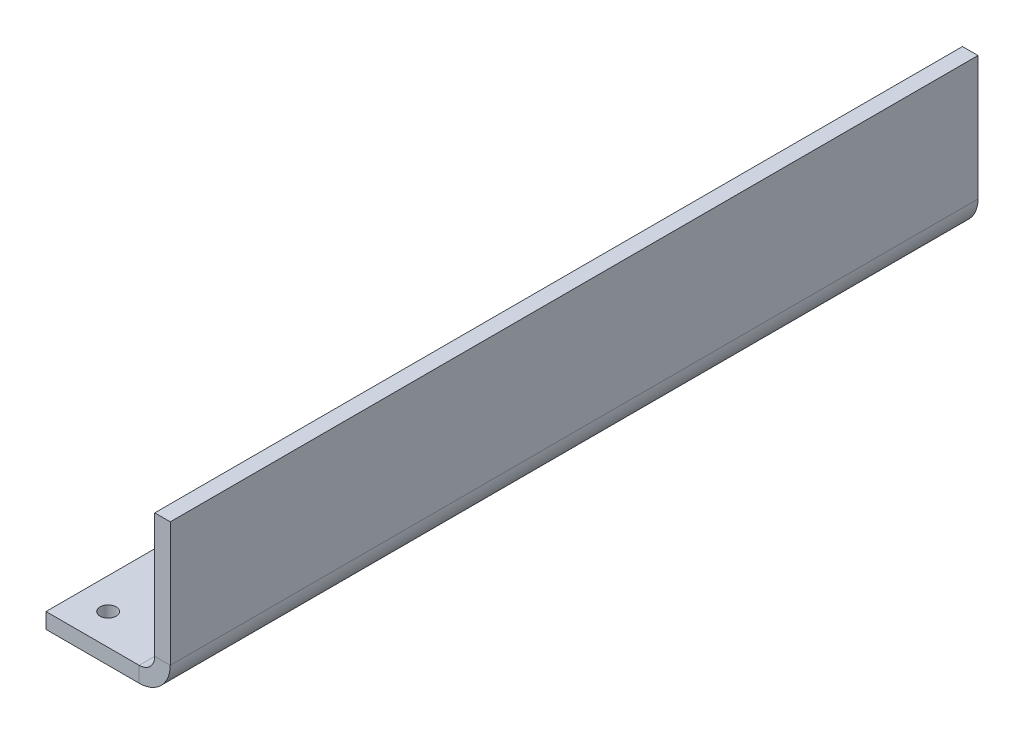
ISO-10303-21;
HEADER;
FILE_DESCRIPTION(('STEP AP214'),'2;1');
FILE_NAME('part.step','',(''),(''),'','','');
FILE_SCHEMA(('AUTOMOTIVE_DESIGN { 1 0 10303 214 1 1 1 1 }'));
ENDSEC;
DATA;
#1=APPLICATION_CONTEXT('core data for automotive mechanical design processes');
#2=APPLICATION_PROTOCOL_DEFINITION('international standard','automotive_design',2000,#1);
#3=PRODUCT_CONTEXT('',#1,'mechanical');
#4=PRODUCT('Part','Part','',(#3));
#5=PRODUCT_RELATED_PRODUCT_CATEGORY('part','',(#4));
#6=PRODUCT_DEFINITION_FORMATION('','',#4);
#7=PRODUCT_DEFINITION_CONTEXT('part definition',#1,'design');
#8=PRODUCT_DEFINITION('design','',#6,#7);
#9=PRODUCT_DEFINITION_SHAPE('','',#8);
#10=(LENGTH_UNIT() NAMED_UNIT(*) SI_UNIT(.MILLI.,.METRE.));
#11=(NAMED_UNIT(*) PLANE_ANGLE_UNIT() SI_UNIT($,.RADIAN.));
#12=(NAMED_UNIT(*) SI_UNIT($,.STERADIAN.) SOLID_ANGLE_UNIT());
#13=UNCERTAINTY_MEASURE_WITH_UNIT(LENGTH_MEASURE(1.E-05),#10,'distance_accuracy_value','');
#14=(GEOMETRIC_REPRESENTATION_CONTEXT(3) GLOBAL_UNCERTAINTY_ASSIGNED_CONTEXT((#13)) GLOBAL_UNIT_ASSIGNED_CONTEXT((#10,
#11,#12)) REPRESENTATION_CONTEXT('',''));
#15=CARTESIAN_POINT('',(0.,0.,0.));
#16=DIRECTION('',(0.,0.,1.));
#17=DIRECTION('',(1.,0.,0.));
#18=AXIS2_PLACEMENT_3D('',#15,#16,#17);
#19=CARTESIAN_POINT('',(-3.175,-12.7,-82.55));
#20=DIRECTION('',(0.,0.,-1.));
#21=DIRECTION('',(-1.,0.,0.));
#22=AXIS2_PLACEMENT_3D('',#19,#20,#21);
#23=PLANE('',#22);
#24=DIRECTION('',(0.,1.,0.));
#25=VECTOR('',#24,1.);
#26=CARTESIAN_POINT('',(0.,-12.7,-82.55));
#27=LINE('',#26,#25);
#28=CARTESIAN_POINT('',(0.,-12.7,-82.55));
#29=VERTEX_POINT('',#28);
#30=CARTESIAN_POINT('',(0.,12.7,-82.55));
#31=VERTEX_POINT('',#30);
#32=EDGE_CURVE('E115',#29,#31,#27,.T.);
#33=ORIENTED_EDGE('',*,*,#32,.F.);
#34=DIRECTION('',(1.,0.,0.));
#35=VECTOR('',#34,1.);
#36=CARTESIAN_POINT('',(-3.175,-12.7,-82.55));
#37=LINE('',#36,#35);
#38=CARTESIAN_POINT('',(-3.175,-12.7,-82.55));
#39=VERTEX_POINT('',#38);
#40=EDGE_CURVE('E13',#39,#29,#37,.T.);
#41=ORIENTED_EDGE('',*,*,#40,.F.);
#42=DIRECTION('',(0.,1.,0.));
#43=VECTOR('',#42,1.);
#44=CARTESIAN_POINT('',(-3.175,-12.7,-82.55));
#45=LINE('',#44,#43);
#46=CARTESIAN_POINT('',(-3.175,12.7,-82.55));
#47=VERTEX_POINT('',#46);
#48=EDGE_CURVE('E138',#39,#47,#45,.T.);
#49=ORIENTED_EDGE('',*,*,#48,.T.);
#50=DIRECTION('',(1.,0.,0.));
#51=VECTOR('',#50,1.);
#52=CARTESIAN_POINT('',(-3.175,12.7,-82.55));
#53=LINE('',#52,#51);
#54=EDGE_CURVE('E68',#47,#31,#53,.T.);
#55=ORIENTED_EDGE('',*,*,#54,.T.);
#56=EDGE_LOOP('',(#33,#41,#49,#55));
#57=FACE_BOUND('',#56,.T.);
#58=ADVANCED_FACE('F65',(#57),#23,.T.);
#59=CARTESIAN_POINT('',(-3.175,-12.7,82.55));
#60=DIRECTION('',(0.,0.,1.));
#61=DIRECTION('',(1.,0.,0.));
#62=AXIS2_PLACEMENT_3D('',#59,#60,#61);
#63=PLANE('',#62);
#64=DIRECTION('',(0.,-1.,0.));
#65=VECTOR('',#64,1.);
#66=CARTESIAN_POINT('',(0.,-12.7,82.55));
#67=LINE('',#66,#65);
#68=CARTESIAN_POINT('',(0.,12.7,82.55));
#69=VERTEX_POINT('',#68);
#70=CARTESIAN_POINT('',(0.,-12.7,82.55));
#71=VERTEX_POINT('',#70);
#72=EDGE_CURVE('E136',#69,#71,#67,.T.);
#73=ORIENTED_EDGE('',*,*,#72,.F.);
#74=DIRECTION('',(1.,0.,0.));
#75=VECTOR('',#74,1.);
#76=CARTESIAN_POINT('',(-3.175,12.7,82.55));
#77=LINE('',#76,#75);
#78=CARTESIAN_POINT('',(-3.175,12.7,82.55));
#79=VERTEX_POINT('',#78);
#80=EDGE_CURVE('E84',#79,#69,#77,.T.);
#81=ORIENTED_EDGE('',*,*,#80,.F.);
#82=DIRECTION('',(0.,-1.,0.));
#83=VECTOR('',#82,1.);
#84=CARTESIAN_POINT('',(-3.175,-12.7,82.55));
#85=LINE('',#84,#83);
#86=CARTESIAN_POINT('',(-3.175,-12.7,82.55));
#87=VERTEX_POINT('',#86);
#88=EDGE_CURVE('E157',#79,#87,#85,.T.);
#89=ORIENTED_EDGE('',*,*,#88,.T.);
#90=DIRECTION('',(1.,0.,0.));
#91=VECTOR('',#90,1.);
#92=CARTESIAN_POINT('',(-3.175,-12.7,82.55));
#93=LINE('',#92,#91);
#94=EDGE_CURVE('E75',#87,#71,#93,.T.);
#95=ORIENTED_EDGE('',*,*,#94,.T.);
#96=EDGE_LOOP('',(#73,#81,#89,#95));
#97=FACE_BOUND('',#96,.T.);
#98=ADVANCED_FACE('F330',(#97),#63,.T.);
#99=CARTESIAN_POINT('',(-3.175,12.7,82.55));
#100=DIRECTION('',(0.,1.,0.));
#101=DIRECTION('',(0.,0.,1.));
#102=AXIS2_PLACEMENT_3D('',#99,#100,#101);
#103=PLANE('',#102);
#104=DIRECTION('',(0.,0.,1.));
#105=VECTOR('',#104,1.);
#106=CARTESIAN_POINT('',(0.,12.7,82.55));
#107=LINE('',#106,#105);
#108=EDGE_CURVE('E132',#31,#69,#107,.T.);
#109=ORIENTED_EDGE('',*,*,#108,.F.);
#110=ORIENTED_EDGE('',*,*,#54,.F.);
#111=DIRECTION('',(0.,0.,1.));
#112=VECTOR('',#111,1.);
#113=CARTESIAN_POINT('',(-3.175,12.7,82.55));
#114=LINE('',#113,#112);
#115=EDGE_CURVE('E143',#47,#79,#114,.T.);
#116=ORIENTED_EDGE('',*,*,#115,.T.);
#117=ORIENTED_EDGE('',*,*,#80,.T.);
#118=EDGE_LOOP('',(#109,#110,#116,#117));
#119=FACE_BOUND('',#118,.T.);
#120=ADVANCED_FACE('F168',(#119),#103,.T.);
#121=CARTESIAN_POINT('',(-3.175,0.,0.));
#122=DIRECTION('',(-1.,0.,0.));
#123=DIRECTION('',(0.,0.,1.));
#124=AXIS2_PLACEMENT_3D('',#121,#122,#123);
#125=PLANE('',#124);
#126=ORIENTED_EDGE('',*,*,#48,.F.);
#127=DIRECTION('',(0.,0.,-1.));
#128=VECTOR('',#127,1.);
#129=CARTESIAN_POINT('',(-3.175,-12.7,82.55));
#130=LINE('',#129,#128);
#131=EDGE_CURVE('E153',#87,#39,#130,.T.);
#132=ORIENTED_EDGE('',*,*,#131,.F.);
#133=ORIENTED_EDGE('',*,*,#88,.F.);
#134=ORIENTED_EDGE('',*,*,#115,.F.);
#135=EDGE_LOOP('',(#126,#132,#133,#134));
#136=FACE_BOUND('',#135,.T.);
#137=ADVANCED_FACE('F171',(#136),#125,.T.);
#138=CARTESIAN_POINT('',(0.,0.,0.));
#139=DIRECTION('',(-1.,0.,0.));
#140=DIRECTION('',(0.,0.,1.));
#141=AXIS2_PLACEMENT_3D('',#138,#139,#140);
#142=PLANE('',#141);
#143=ORIENTED_EDGE('',*,*,#32,.T.);
#144=ORIENTED_EDGE('',*,*,#108,.T.);
#145=ORIENTED_EDGE('',*,*,#72,.T.);
#146=DIRECTION('',(0.,0.,-1.));
#147=VECTOR('',#146,1.);
#148=CARTESIAN_POINT('',(0.,-12.7,82.55));
#149=LINE('',#148,#147);
#150=EDGE_CURVE('E106',#71,#29,#149,.T.);
#151=ORIENTED_EDGE('',*,*,#150,.T.);
#152=EDGE_LOOP('',(#143,#144,#145,#151));
#153=FACE_BOUND('',#152,.T.);
#154=ADVANCED_FACE('F135',(#153),#142,.F.);
#155=CARTESIAN_POINT('',(-6.35,-12.7,-82.55));
#156=DIRECTION('',(0.,0.,-1.));
#157=DIRECTION('',(-1.,0.,0.));
#158=AXIS2_PLACEMENT_3D('',#155,#156,#157);
#159=PLANE('',#158);
#160=DIRECTION('',(0.,1.,0.));
#161=VECTOR('',#160,1.);
#162=CARTESIAN_POINT('',(-6.34999999999998,-19.05,-82.55));
#163=LINE('',#162,#161);
#164=CARTESIAN_POINT('',(-6.34999999999999,-15.875,-82.55));
#165=VERTEX_POINT('',#164);
#166=CARTESIAN_POINT('',(-6.34999999999998,-19.05,-82.55));
#167=VERTEX_POINT('',#166);
#168=EDGE_CURVE('E183',#165,#167,#163,.F.);
#169=ORIENTED_EDGE('',*,*,#168,.F.);
#170=CARTESIAN_POINT('',(-6.35,-12.7,-82.55));
#171=DIRECTION('',(0.,0.,1.));
#172=DIRECTION('',(1.,0.,0.));
#173=AXIS2_PLACEMENT_3D('',#170,#171,#172);
#174=CIRCLE('',#173,3.175);
#175=EDGE_CURVE('E124',#39,#165,#174,.F.);
#176=ORIENTED_EDGE('',*,*,#175,.F.);
#177=ORIENTED_EDGE('',*,*,#40,.T.);
#178=CARTESIAN_POINT('',(-6.35,-12.7,-82.55));
#179=DIRECTION('',(0.,0.,1.));
#180=DIRECTION('',(1.,0.,0.));
#181=AXIS2_PLACEMENT_3D('',#178,#179,#180);
#182=CIRCLE('',#181,6.35);
#183=EDGE_CURVE('E102',#29,#167,#182,.F.);
#184=ORIENTED_EDGE('',*,*,#183,.T.);
#185=EDGE_LOOP('',(#169,#176,#177,#184));
#186=FACE_BOUND('',#185,.T.);
#187=ADVANCED_FACE('F121',(#186),#159,.T.);
#188=CARTESIAN_POINT('',(-6.35,-12.7,82.55));
#189=DIRECTION('',(0.,0.,-1.));
#190=DIRECTION('',(-1.,0.,0.));
#191=AXIS2_PLACEMENT_3D('',#188,#189,#190);
#192=PLANE('',#191);
#193=CARTESIAN_POINT('',(-6.35,-12.7,82.55));
#194=DIRECTION('',(0.,0.,1.));
#195=DIRECTION('',(1.,0.,0.));
#196=AXIS2_PLACEMENT_3D('',#193,#194,#195);
#197=CIRCLE('',#196,3.175);
#198=CARTESIAN_POINT('',(-6.34999999999999,-15.875,82.55));
#199=VERTEX_POINT('',#198);
#200=EDGE_CURVE('E175',#199,#87,#197,.T.);
#201=ORIENTED_EDGE('',*,*,#200,.F.);
#202=DIRECTION('',(0.,1.,0.));
#203=VECTOR('',#202,1.);
#204=CARTESIAN_POINT('',(-6.34999999999998,-15.875,82.55));
#205=LINE('',#204,#203);
#206=CARTESIAN_POINT('',(-6.34999999999997,-19.05,82.55));
#207=VERTEX_POINT('',#206);
#208=EDGE_CURVE('E191',#199,#207,#205,.F.);
#209=ORIENTED_EDGE('',*,*,#208,.T.);
#210=CARTESIAN_POINT('',(-6.35,-12.7,82.55));
#211=DIRECTION('',(0.,0.,1.));
#212=DIRECTION('',(1.,0.,0.));
#213=AXIS2_PLACEMENT_3D('',#210,#211,#212);
#214=CIRCLE('',#213,6.35);
#215=EDGE_CURVE('E116',#207,#71,#214,.T.);
#216=ORIENTED_EDGE('',*,*,#215,.T.);
#217=ORIENTED_EDGE('',*,*,#94,.F.);
#218=EDGE_LOOP('',(#201,#209,#216,#217));
#219=FACE_BOUND('',#218,.T.);
#220=ADVANCED_FACE('F328',(#219),#192,.F.);
#221=CARTESIAN_POINT('',(-6.35,-12.7,82.55));
#222=DIRECTION('',(0.,0.,1.));
#223=DIRECTION('',(0.,-1.,0.));
#224=AXIS2_PLACEMENT_3D('',#221,#222,#223);
#225=CYLINDRICAL_SURFACE('',#224,6.35);
#226=ORIENTED_EDGE('',*,*,#150,.F.);
#227=ORIENTED_EDGE('',*,*,#215,.F.);
#228=DIRECTION('',(0.,0.,1.));
#229=VECTOR('',#228,1.);
#230=CARTESIAN_POINT('',(-6.34999999999998,-19.05,0.));
#231=LINE('',#230,#229);
#232=EDGE_CURVE('E110',#167,#207,#231,.T.);
#233=ORIENTED_EDGE('',*,*,#232,.F.);
#234=ORIENTED_EDGE('',*,*,#183,.F.);
#235=EDGE_LOOP('',(#226,#227,#233,#234));
#236=FACE_BOUND('',#235,.T.);
#237=ADVANCED_FACE('F103',(#236),#225,.T.);
#238=CARTESIAN_POINT('',(-6.35,-12.7,82.55));
#239=DIRECTION('',(0.,0.,1.));
#240=DIRECTION('',(0.,-1.,0.));
#241=AXIS2_PLACEMENT_3D('',#238,#239,#240);
#242=CYLINDRICAL_SURFACE('',#241,3.175);
#243=ORIENTED_EDGE('',*,*,#131,.T.);
#244=ORIENTED_EDGE('',*,*,#175,.T.);
#245=DIRECTION('',(0.,0.,-1.));
#246=VECTOR('',#245,1.);
#247=CARTESIAN_POINT('',(-6.34999999999999,-15.875,-82.55));
#248=LINE('',#247,#246);
#249=EDGE_CURVE('E186',#165,#199,#248,.F.);
#250=ORIENTED_EDGE('',*,*,#249,.T.);
#251=ORIENTED_EDGE('',*,*,#200,.T.);
#252=EDGE_LOOP('',(#243,#244,#250,#251));
#253=FACE_BOUND('',#252,.T.);
#254=ADVANCED_FACE('F329',(#253),#242,.F.);
#255=CARTESIAN_POINT('',(-3.17499999999999,-19.05,82.55));
#256=DIRECTION('',(0.,0.,-1.));
#257=DIRECTION('',(-1.,0.,0.));
#258=AXIS2_PLACEMENT_3D('',#255,#256,#257);
#259=PLANE('',#258);
#260=ORIENTED_EDGE('',*,*,#208,.F.);
#261=DIRECTION('',(-1.,0.,0.));
#262=VECTOR('',#261,1.);
#263=CARTESIAN_POINT('',(-3.175,-15.875,82.55));
#264=LINE('',#263,#262);
#265=CARTESIAN_POINT('',(-25.4,-15.8750000000001,82.55));
#266=VERTEX_POINT('',#265);
#267=EDGE_CURVE('E197',#199,#266,#264,.T.);
#268=ORIENTED_EDGE('',*,*,#267,.T.);
#269=DIRECTION('',(0.,1.,0.));
#270=VECTOR('',#269,1.);
#271=CARTESIAN_POINT('',(-25.4,-19.0500000000001,82.55));
#272=LINE('',#271,#270);
#273=CARTESIAN_POINT('',(-25.4,-19.0500000000001,82.55));
#274=VERTEX_POINT('',#273);
#275=EDGE_CURVE('E178',#274,#266,#272,.T.);
#276=ORIENTED_EDGE('',*,*,#275,.F.);
#277=DIRECTION('',(1.,0.,0.));
#278=VECTOR('',#277,1.);
#279=CARTESIAN_POINT('',(0.,-19.05,82.55));
#280=LINE('',#279,#278);
#281=EDGE_CURVE('E209',#207,#274,#280,.F.);
#282=ORIENTED_EDGE('',*,*,#281,.F.);
#283=EDGE_LOOP('',(#260,#268,#276,#282));
#284=FACE_BOUND('',#283,.T.);
#285=ADVANCED_FACE('F348',(#284),#259,.F.);
#286=CARTESIAN_POINT('',(-25.4,-19.0500000000001,-82.55));
#287=DIRECTION('',(0.,0.,1.));
#288=DIRECTION('',(1.,0.,0.));
#289=AXIS2_PLACEMENT_3D('',#286,#287,#288);
#290=PLANE('',#289);
#291=ORIENTED_EDGE('',*,*,#168,.T.);
#292=DIRECTION('',(-1.,0.,0.));
#293=VECTOR('',#292,1.);
#294=CARTESIAN_POINT('',(0.,-19.05,-82.55));
#295=LINE('',#294,#293);
#296=CARTESIAN_POINT('',(-25.4,-19.0500000000001,-82.55));
#297=VERTEX_POINT('',#296);
#298=EDGE_CURVE('E217',#297,#167,#295,.F.);
#299=ORIENTED_EDGE('',*,*,#298,.F.);
#300=DIRECTION('',(0.,1.,0.));
#301=VECTOR('',#300,1.);
#302=CARTESIAN_POINT('',(-25.4,-19.0500000000001,-82.55));
#303=LINE('',#302,#301);
#304=CARTESIAN_POINT('',(-25.4,-15.8750000000001,-82.55));
#305=VERTEX_POINT('',#304);
#306=EDGE_CURVE('E221',#297,#305,#303,.T.);
#307=ORIENTED_EDGE('',*,*,#306,.T.);
#308=DIRECTION('',(1.,0.,0.));
#309=VECTOR('',#308,1.);
#310=CARTESIAN_POINT('',(-25.4,-15.8750000000001,-82.55));
#311=LINE('',#310,#309);
#312=EDGE_CURVE('E205',#305,#165,#311,.T.);
#313=ORIENTED_EDGE('',*,*,#312,.T.);
#314=EDGE_LOOP('',(#291,#299,#307,#313));
#315=FACE_BOUND('',#314,.T.);
#316=ADVANCED_FACE('F307',(#315),#290,.F.);
#317=CARTESIAN_POINT('',(0.,-19.05,0.));
#318=DIRECTION('',(0.,-1.,0.));
#319=DIRECTION('',(1.,0.,0.));
#320=AXIS2_PLACEMENT_3D('',#317,#318,#319);
#321=PLANE('',#320);
#322=CARTESIAN_POINT('',(-12.7,-19.05,-76.2));
#323=DIRECTION('',(0.,1.,0.));
#324=DIRECTION('',(0.,0.,1.));
#325=AXIS2_PLACEMENT_3D('',#322,#323,#324);
#326=CIRCLE('',#325,1.651);
#327=CARTESIAN_POINT('',(-12.7,-19.05,-74.549));
#328=VERTEX_POINT('',#327);
#329=EDGE_CURVE('E267',#328,#328,#326,.T.);
#330=ORIENTED_EDGE('',*,*,#329,.T.);
#331=EDGE_LOOP('',(#330));
#332=FACE_BOUND('',#331,.T.);
#333=CARTESIAN_POINT('',(-19.05,-19.05,-50.8));
#334=DIRECTION('',(0.,1.,0.));
#335=DIRECTION('',(0.,0.,1.));
#336=AXIS2_PLACEMENT_3D('',#333,#334,#335);
#337=CIRCLE('',#336,1.651);
#338=CARTESIAN_POINT('',(-19.05,-19.05,-49.149));
#339=VERTEX_POINT('',#338);
#340=EDGE_CURVE('E259',#339,#339,#337,.T.);
#341=ORIENTED_EDGE('',*,*,#340,.T.);
#342=EDGE_LOOP('',(#341));
#343=FACE_BOUND('',#342,.T.);
#344=CARTESIAN_POINT('',(-12.7,-19.05,-12.7));
#345=DIRECTION('',(0.,1.,0.));
#346=DIRECTION('',(0.,0.,1.));
#347=AXIS2_PLACEMENT_3D('',#344,#345,#346);
#348=CIRCLE('',#347,1.651);
#349=CARTESIAN_POINT('',(-12.7,-19.05,-11.049));
#350=VERTEX_POINT('',#349);
#351=EDGE_CURVE('E251',#350,#350,#348,.T.);
#352=ORIENTED_EDGE('',*,*,#351,.T.);
#353=EDGE_LOOP('',(#352));
#354=FACE_BOUND('',#353,.T.);
#355=CARTESIAN_POINT('',(-19.05,-19.05,12.7));
#356=DIRECTION('',(0.,1.,0.));
#357=DIRECTION('',(0.,0.,1.));
#358=AXIS2_PLACEMENT_3D('',#355,#356,#357);
#359=CIRCLE('',#358,1.651);
#360=CARTESIAN_POINT('',(-19.05,-19.05,14.351));
#361=VERTEX_POINT('',#360);
#362=EDGE_CURVE('E243',#361,#361,#359,.T.);
#363=ORIENTED_EDGE('',*,*,#362,.T.);
#364=EDGE_LOOP('',(#363));
#365=FACE_BOUND('',#364,.T.);
#366=CARTESIAN_POINT('',(-12.7,-19.05,50.8));
#367=DIRECTION('',(0.,1.,0.));
#368=DIRECTION('',(0.,0.,1.));
#369=AXIS2_PLACEMENT_3D('',#366,#367,#368);
#370=CIRCLE('',#369,1.651);
#371=CARTESIAN_POINT('',(-12.7,-19.05,52.451));
#372=VERTEX_POINT('',#371);
#373=EDGE_CURVE('E235',#372,#372,#370,.T.);
#374=ORIENTED_EDGE('',*,*,#373,.T.);
#375=EDGE_LOOP('',(#374));
#376=FACE_BOUND('',#375,.T.);
#377=CARTESIAN_POINT('',(-19.05,-19.05,76.2));
#378=DIRECTION('',(0.,1.,0.));
#379=DIRECTION('',(0.,0.,1.));
#380=AXIS2_PLACEMENT_3D('',#377,#378,#379);
#381=CIRCLE('',#380,1.651);
#382=CARTESIAN_POINT('',(-19.05,-19.05,77.851));
#383=VERTEX_POINT('',#382);
#384=EDGE_CURVE('E187',#383,#383,#381,.T.);
#385=ORIENTED_EDGE('',*,*,#384,.T.);
#386=EDGE_LOOP('',(#385));
#387=FACE_BOUND('',#386,.T.);
#388=ORIENTED_EDGE('',*,*,#298,.T.);
#389=ORIENTED_EDGE('',*,*,#232,.T.);
#390=ORIENTED_EDGE('',*,*,#281,.T.);
#391=DIRECTION('',(0.,0.,1.));
#392=VECTOR('',#391,1.);
#393=CARTESIAN_POINT('',(-25.4,-19.0500000000001,0.));
#394=LINE('',#393,#392);
#395=EDGE_CURVE('E213',#274,#297,#394,.F.);
#396=ORIENTED_EDGE('',*,*,#395,.T.);
#397=EDGE_LOOP('',(#388,#389,#390,#396));
#398=FACE_BOUND('',#397,.T.);
#399=ADVANCED_FACE('F283',(#332,#343,#354,#365,#376,#387,#398),#321,.T.);
#400=CARTESIAN_POINT('',(0.,-15.875,0.));
#401=DIRECTION('',(0.,-1.,0.));
#402=DIRECTION('',(1.,0.,0.));
#403=AXIS2_PLACEMENT_3D('',#400,#401,#402);
#404=PLANE('',#403);
#405=CARTESIAN_POINT('',(-12.7,-15.875,-76.2));
#406=DIRECTION('',(0.,1.,0.));
#407=DIRECTION('',(0.,0.,1.));
#408=AXIS2_PLACEMENT_3D('',#405,#406,#407);
#409=CIRCLE('',#408,1.651);
#410=CARTESIAN_POINT('',(-12.7,-15.875,-74.549));
#411=VERTEX_POINT('',#410);
#412=EDGE_CURVE('E271',#411,#411,#409,.T.);
#413=ORIENTED_EDGE('',*,*,#412,.F.);
#414=EDGE_LOOP('',(#413));
#415=FACE_BOUND('',#414,.T.);
#416=CARTESIAN_POINT('',(-19.05,-15.875,-50.8));
#417=DIRECTION('',(0.,1.,0.));
#418=DIRECTION('',(0.,0.,1.));
#419=AXIS2_PLACEMENT_3D('',#416,#417,#418);
#420=CIRCLE('',#419,1.651);
#421=CARTESIAN_POINT('',(-19.05,-15.875,-49.149));
#422=VERTEX_POINT('',#421);
#423=EDGE_CURVE('E263',#422,#422,#420,.T.);
#424=ORIENTED_EDGE('',*,*,#423,.F.);
#425=EDGE_LOOP('',(#424));
#426=FACE_BOUND('',#425,.T.);
#427=CARTESIAN_POINT('',(-12.7,-15.875,-12.7));
#428=DIRECTION('',(0.,1.,0.));
#429=DIRECTION('',(0.,0.,1.));
#430=AXIS2_PLACEMENT_3D('',#427,#428,#429);
#431=CIRCLE('',#430,1.651);
#432=CARTESIAN_POINT('',(-12.7,-15.875,-11.049));
#433=VERTEX_POINT('',#432);
#434=EDGE_CURVE('E255',#433,#433,#431,.T.);
#435=ORIENTED_EDGE('',*,*,#434,.F.);
#436=EDGE_LOOP('',(#435));
#437=FACE_BOUND('',#436,.T.);
#438=CARTESIAN_POINT('',(-19.05,-15.875,12.7));
#439=DIRECTION('',(0.,1.,0.));
#440=DIRECTION('',(0.,0.,1.));
#441=AXIS2_PLACEMENT_3D('',#438,#439,#440);
#442=CIRCLE('',#441,1.651);
#443=CARTESIAN_POINT('',(-19.05,-15.875,14.351));
#444=VERTEX_POINT('',#443);
#445=EDGE_CURVE('E247',#444,#444,#442,.T.);
#446=ORIENTED_EDGE('',*,*,#445,.F.);
#447=EDGE_LOOP('',(#446));
#448=FACE_BOUND('',#447,.T.);
#449=CARTESIAN_POINT('',(-12.7,-15.875,50.8));
#450=DIRECTION('',(0.,1.,0.));
#451=DIRECTION('',(0.,0.,1.));
#452=AXIS2_PLACEMENT_3D('',#449,#450,#451);
#453=CIRCLE('',#452,1.651);
#454=CARTESIAN_POINT('',(-12.7,-15.875,52.451));
#455=VERTEX_POINT('',#454);
#456=EDGE_CURVE('E239',#455,#455,#453,.T.);
#457=ORIENTED_EDGE('',*,*,#456,.F.);
#458=EDGE_LOOP('',(#457));
#459=FACE_BOUND('',#458,.T.);
#460=CARTESIAN_POINT('',(-19.05,-15.875,76.2));
#461=DIRECTION('',(0.,1.,0.));
#462=DIRECTION('',(0.,0.,1.));
#463=AXIS2_PLACEMENT_3D('',#460,#461,#462);
#464=CIRCLE('',#463,1.651);
#465=CARTESIAN_POINT('',(-19.05,-15.875,77.851));
#466=VERTEX_POINT('',#465);
#467=EDGE_CURVE('E231',#466,#466,#464,.T.);
#468=ORIENTED_EDGE('',*,*,#467,.F.);
#469=EDGE_LOOP('',(#468));
#470=FACE_BOUND('',#469,.T.);
#471=ORIENTED_EDGE('',*,*,#249,.F.);
#472=ORIENTED_EDGE('',*,*,#312,.F.);
#473=DIRECTION('',(0.,0.,-1.));
#474=VECTOR('',#473,1.);
#475=CARTESIAN_POINT('',(-25.4,-15.8750000000001,82.55));
#476=LINE('',#475,#474);
#477=EDGE_CURVE('E201',#266,#305,#476,.T.);
#478=ORIENTED_EDGE('',*,*,#477,.F.);
#479=ORIENTED_EDGE('',*,*,#267,.F.);
#480=EDGE_LOOP('',(#471,#472,#478,#479));
#481=FACE_BOUND('',#480,.T.);
#482=ADVANCED_FACE('F279',(#415,#426,#437,#448,#459,#470,#481),#404,.F.);
#483=CARTESIAN_POINT('',(-25.4,-19.0500000000001,82.55));
#484=DIRECTION('',(1.,0.,0.));
#485=DIRECTION('',(0.,1.,0.));
#486=AXIS2_PLACEMENT_3D('',#483,#484,#485);
#487=PLANE('',#486);
#488=ORIENTED_EDGE('',*,*,#477,.T.);
#489=ORIENTED_EDGE('',*,*,#306,.F.);
#490=ORIENTED_EDGE('',*,*,#395,.F.);
#491=ORIENTED_EDGE('',*,*,#275,.T.);
#492=EDGE_LOOP('',(#488,#489,#490,#491));
#493=FACE_BOUND('',#492,.T.);
#494=ADVANCED_FACE('F282',(#493),#487,.F.);
#495=CARTESIAN_POINT('',(-19.05,-15.875,76.2));
#496=DIRECTION('',(0.,1.,0.));
#497=DIRECTION('',(0.,0.,1.));
#498=AXIS2_PLACEMENT_3D('',#495,#496,#497);
#499=CYLINDRICAL_SURFACE('',#498,1.651);
#500=ORIENTED_EDGE('',*,*,#384,.F.);
#501=EDGE_LOOP('',(#500));
#502=FACE_BOUND('',#501,.T.);
#503=ORIENTED_EDGE('',*,*,#467,.T.);
#504=EDGE_LOOP('',(#503));
#505=FACE_BOUND('',#504,.T.);
#506=ADVANCED_FACE('F356',(#502,#505),#499,.F.);
#507=CARTESIAN_POINT('',(-12.7,-15.875,50.8));
#508=DIRECTION('',(0.,1.,0.));
#509=DIRECTION('',(0.,0.,1.));
#510=AXIS2_PLACEMENT_3D('',#507,#508,#509);
#511=CYLINDRICAL_SURFACE('',#510,1.651);
#512=ORIENTED_EDGE('',*,*,#373,.F.);
#513=EDGE_LOOP('',(#512));
#514=FACE_BOUND('',#513,.T.);
#515=ORIENTED_EDGE('',*,*,#456,.T.);
#516=EDGE_LOOP('',(#515));
#517=FACE_BOUND('',#516,.T.);
#518=ADVANCED_FACE('F364',(#514,#517),#511,.F.);
#519=CARTESIAN_POINT('',(-19.05,-15.875,12.7));
#520=DIRECTION('',(0.,1.,0.));
#521=DIRECTION('',(0.,0.,1.));
#522=AXIS2_PLACEMENT_3D('',#519,#520,#521);
#523=CYLINDRICAL_SURFACE('',#522,1.651);
#524=ORIENTED_EDGE('',*,*,#362,.F.);
#525=EDGE_LOOP('',(#524));
#526=FACE_BOUND('',#525,.T.);
#527=ORIENTED_EDGE('',*,*,#445,.T.);
#528=EDGE_LOOP('',(#527));
#529=FACE_BOUND('',#528,.T.);
#530=ADVANCED_FACE('F368',(#526,#529),#523,.F.);
#531=CARTESIAN_POINT('',(-12.7,-15.875,-12.7));
#532=DIRECTION('',(0.,1.,0.));
#533=DIRECTION('',(0.,0.,1.));
#534=AXIS2_PLACEMENT_3D('',#531,#532,#533);
#535=CYLINDRICAL_SURFACE('',#534,1.651);
#536=ORIENTED_EDGE('',*,*,#351,.F.);
#537=EDGE_LOOP('',(#536));
#538=FACE_BOUND('',#537,.T.);
#539=ORIENTED_EDGE('',*,*,#434,.T.);
#540=EDGE_LOOP('',(#539));
#541=FACE_BOUND('',#540,.T.);
#542=ADVANCED_FACE('F372',(#538,#541),#535,.F.);
#543=CARTESIAN_POINT('',(-19.05,-15.875,-50.8));
#544=DIRECTION('',(0.,1.,0.));
#545=DIRECTION('',(0.,0.,1.));
#546=AXIS2_PLACEMENT_3D('',#543,#544,#545);
#547=CYLINDRICAL_SURFACE('',#546,1.651);
#548=ORIENTED_EDGE('',*,*,#340,.F.);
#549=EDGE_LOOP('',(#548));
#550=FACE_BOUND('',#549,.T.);
#551=ORIENTED_EDGE('',*,*,#423,.T.);
#552=EDGE_LOOP('',(#551));
#553=FACE_BOUND('',#552,.T.);
#554=ADVANCED_FACE('F376',(#550,#553),#547,.F.);
#555=CARTESIAN_POINT('',(-12.7,-15.875,-76.2));
#556=DIRECTION('',(0.,1.,0.));
#557=DIRECTION('',(0.,0.,1.));
#558=AXIS2_PLACEMENT_3D('',#555,#556,#557);
#559=CYLINDRICAL_SURFACE('',#558,1.651);
#560=ORIENTED_EDGE('',*,*,#329,.F.);
#561=EDGE_LOOP('',(#560));
#562=FACE_BOUND('',#561,.T.);
#563=ORIENTED_EDGE('',*,*,#412,.T.);
#564=EDGE_LOOP('',(#563));
#565=FACE_BOUND('',#564,.T.);
#566=ADVANCED_FACE('F277',(#562,#565),#559,.F.);
#567=CLOSED_SHELL('',(#58,#98,#120,#137,#154,#187,#220,#237,#254,#285,#316,#399,#482,#494,#506,
#518,#530,#542,#554,#566));
#568=MANIFOLD_SOLID_BREP('B2',#567);
#569=ADVANCED_BREP_SHAPE_REPRESENTATION('',(#18,#568),#14);
#570=SHAPE_DEFINITION_REPRESENTATION(#9,#569);
ENDSEC;
END-ISO-10303-21;
